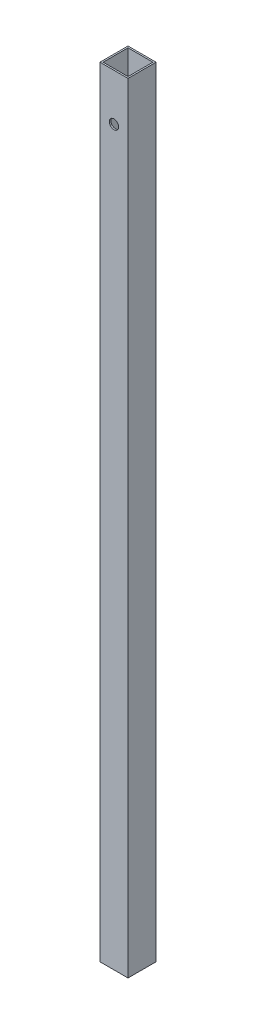
ISO-10303-21;
HEADER;
FILE_DESCRIPTION(('STEP AP214'),'2;1');
FILE_NAME('part.step','',(''),(''),'','','');
FILE_SCHEMA(('AUTOMOTIVE_DESIGN { 1 0 10303 214 1 1 1 1 }'));
ENDSEC;
DATA;
#1=APPLICATION_CONTEXT('core data for automotive mechanical design processes');
#2=APPLICATION_PROTOCOL_DEFINITION('international standard','automotive_design',2000,#1);
#3=PRODUCT_CONTEXT('',#1,'mechanical');
#4=PRODUCT('Part','Part','',(#3));
#5=PRODUCT_RELATED_PRODUCT_CATEGORY('part','',(#4));
#6=PRODUCT_DEFINITION_FORMATION('','',#4);
#7=PRODUCT_DEFINITION_CONTEXT('part definition',#1,'design');
#8=PRODUCT_DEFINITION('design','',#6,#7);
#9=PRODUCT_DEFINITION_SHAPE('','',#8);
#10=(LENGTH_UNIT() NAMED_UNIT(*) SI_UNIT(.MILLI.,.METRE.));
#11=(NAMED_UNIT(*) PLANE_ANGLE_UNIT() SI_UNIT($,.RADIAN.));
#12=(NAMED_UNIT(*) SI_UNIT($,.STERADIAN.) SOLID_ANGLE_UNIT());
#13=UNCERTAINTY_MEASURE_WITH_UNIT(LENGTH_MEASURE(1.E-05),#10,'distance_accuracy_value','');
#14=(GEOMETRIC_REPRESENTATION_CONTEXT(3) GLOBAL_UNCERTAINTY_ASSIGNED_CONTEXT((#13)) GLOBAL_UNIT_ASSIGNED_CONTEXT((#10,
#11,#12)) REPRESENTATION_CONTEXT('',''));
#15=CARTESIAN_POINT('',(0.,0.,0.));
#16=DIRECTION('',(0.,0.,1.));
#17=DIRECTION('',(1.,0.,0.));
#18=AXIS2_PLACEMENT_3D('',#15,#16,#17);
#19=CARTESIAN_POINT('',(0.,500.,0.));
#20=DIRECTION('',(0.,1.,0.));
#21=DIRECTION('',(0.,0.,1.));
#22=AXIS2_PLACEMENT_3D('',#19,#20,#21);
#23=PLANE('',#22);
#24=DIRECTION('',(0.,0.,-1.));
#25=VECTOR('',#24,1.);
#26=CARTESIAN_POINT('',(9.00000000000001,500.,-9.));
#27=LINE('',#26,#25);
#28=CARTESIAN_POINT('',(9.00000000000001,500.,9.00000000000001));
#29=VERTEX_POINT('',#28);
#30=CARTESIAN_POINT('',(9.00000000000001,500.,-9.));
#31=VERTEX_POINT('',#30);
#32=EDGE_CURVE('E142',#29,#31,#27,.T.);
#33=ORIENTED_EDGE('',*,*,#32,.T.);
#34=DIRECTION('',(-1.,0.,0.));
#35=VECTOR('',#34,1.);
#36=CARTESIAN_POINT('',(-9.,500.,-9.));
#37=LINE('',#36,#35);
#38=CARTESIAN_POINT('',(-9.,500.,-9.));
#39=VERTEX_POINT('',#38);
#40=EDGE_CURVE('E145',#31,#39,#37,.T.);
#41=ORIENTED_EDGE('',*,*,#40,.T.);
#42=DIRECTION('',(0.,0.,1.));
#43=VECTOR('',#42,1.);
#44=CARTESIAN_POINT('',(-9.,500.,-9.));
#45=LINE('',#44,#43);
#46=CARTESIAN_POINT('',(-8.99999999999999,500.,9.00000000000001));
#47=VERTEX_POINT('',#46);
#48=EDGE_CURVE('E148',#39,#47,#45,.T.);
#49=ORIENTED_EDGE('',*,*,#48,.T.);
#50=DIRECTION('',(1.,0.,0.));
#51=VECTOR('',#50,1.);
#52=CARTESIAN_POINT('',(-8.99999999999999,500.,9.00000000000001));
#53=LINE('',#52,#51);
#54=EDGE_CURVE('E150',#47,#29,#53,.T.);
#55=ORIENTED_EDGE('',*,*,#54,.T.);
#56=EDGE_LOOP('',(#33,#41,#49,#55));
#57=FACE_BOUND('',#56,.T.);
#58=DIRECTION('',(0.,0.,1.));
#59=VECTOR('',#58,1.);
#60=CARTESIAN_POINT('',(-8.,500.,-8.));
#61=LINE('',#60,#59);
#62=CARTESIAN_POINT('',(-8.,500.,-8.));
#63=VERTEX_POINT('',#62);
#64=CARTESIAN_POINT('',(-7.99999999999999,500.,8.00000000000001));
#65=VERTEX_POINT('',#64);
#66=EDGE_CURVE('E112',#63,#65,#61,.T.);
#67=ORIENTED_EDGE('',*,*,#66,.F.);
#68=DIRECTION('',(-1.,0.,0.));
#69=VECTOR('',#68,1.);
#70=CARTESIAN_POINT('',(-8.,500.,-8.));
#71=LINE('',#70,#69);
#72=CARTESIAN_POINT('',(8.,500.,-8.));
#73=VERTEX_POINT('',#72);
#74=EDGE_CURVE('E104',#73,#63,#71,.T.);
#75=ORIENTED_EDGE('',*,*,#74,.F.);
#76=DIRECTION('',(0.,0.,-1.));
#77=VECTOR('',#76,1.);
#78=CARTESIAN_POINT('',(8.,500.,-8.));
#79=LINE('',#78,#77);
#80=CARTESIAN_POINT('',(8.00000000000001,500.,8.00000000000001));
#81=VERTEX_POINT('',#80);
#82=EDGE_CURVE('E126',#81,#73,#79,.T.);
#83=ORIENTED_EDGE('',*,*,#82,.F.);
#84=DIRECTION('',(1.,0.,0.));
#85=VECTOR('',#84,1.);
#86=CARTESIAN_POINT('',(-7.99999999999999,500.,8.00000000000001));
#87=LINE('',#86,#85);
#88=EDGE_CURVE('E124',#65,#81,#87,.T.);
#89=ORIENTED_EDGE('',*,*,#88,.F.);
#90=EDGE_LOOP('',(#67,#75,#83,#89));
#91=FACE_BOUND('',#90,.T.);
#92=ADVANCED_FACE('F38',(#57,#91),#23,.T.);
#93=CARTESIAN_POINT('',(0.,0.,0.));
#94=DIRECTION('',(0.,1.,0.));
#95=DIRECTION('',(0.,0.,1.));
#96=AXIS2_PLACEMENT_3D('',#93,#94,#95);
#97=PLANE('',#96);
#98=DIRECTION('',(0.,0.,-1.));
#99=VECTOR('',#98,1.);
#100=CARTESIAN_POINT('',(9.00000000000001,0.,-9.));
#101=LINE('',#100,#99);
#102=CARTESIAN_POINT('',(9.00000000000001,0.,9.00000000000001));
#103=VERTEX_POINT('',#102);
#104=CARTESIAN_POINT('',(9.00000000000001,0.,-9.));
#105=VERTEX_POINT('',#104);
#106=EDGE_CURVE('E120',#103,#105,#101,.T.);
#107=ORIENTED_EDGE('',*,*,#106,.F.);
#108=DIRECTION('',(1.,0.,0.));
#109=VECTOR('',#108,1.);
#110=CARTESIAN_POINT('',(-8.99999999999999,0.,9.00000000000001));
#111=LINE('',#110,#109);
#112=CARTESIAN_POINT('',(-8.99999999999999,0.,9.00000000000001));
#113=VERTEX_POINT('',#112);
#114=EDGE_CURVE('E146',#113,#103,#111,.T.);
#115=ORIENTED_EDGE('',*,*,#114,.F.);
#116=DIRECTION('',(0.,0.,1.));
#117=VECTOR('',#116,1.);
#118=CARTESIAN_POINT('',(-9.,0.,-9.));
#119=LINE('',#118,#117);
#120=CARTESIAN_POINT('',(-9.,0.,-9.));
#121=VERTEX_POINT('',#120);
#122=EDGE_CURVE('E157',#121,#113,#119,.T.);
#123=ORIENTED_EDGE('',*,*,#122,.F.);
#124=DIRECTION('',(-1.,0.,0.));
#125=VECTOR('',#124,1.);
#126=CARTESIAN_POINT('',(-9.,0.,-9.));
#127=LINE('',#126,#125);
#128=EDGE_CURVE('E155',#105,#121,#127,.T.);
#129=ORIENTED_EDGE('',*,*,#128,.F.);
#130=EDGE_LOOP('',(#107,#115,#123,#129));
#131=FACE_BOUND('',#130,.T.);
#132=DIRECTION('',(-1.,0.,0.));
#133=VECTOR('',#132,1.);
#134=CARTESIAN_POINT('',(-8.,0.,-8.));
#135=LINE('',#134,#133);
#136=CARTESIAN_POINT('',(8.,0.,-8.));
#137=VERTEX_POINT('',#136);
#138=CARTESIAN_POINT('',(-8.,0.,-8.));
#139=VERTEX_POINT('',#138);
#140=EDGE_CURVE('E62',#137,#139,#135,.T.);
#141=ORIENTED_EDGE('',*,*,#140,.T.);
#142=DIRECTION('',(0.,0.,1.));
#143=VECTOR('',#142,1.);
#144=CARTESIAN_POINT('',(-8.,0.,-8.));
#145=LINE('',#144,#143);
#146=CARTESIAN_POINT('',(-7.99999999999999,0.,8.00000000000001));
#147=VERTEX_POINT('',#146);
#148=EDGE_CURVE('E119',#139,#147,#145,.T.);
#149=ORIENTED_EDGE('',*,*,#148,.T.);
#150=DIRECTION('',(1.,0.,0.));
#151=VECTOR('',#150,1.);
#152=CARTESIAN_POINT('',(-7.99999999999999,0.,8.00000000000001));
#153=LINE('',#152,#151);
#154=CARTESIAN_POINT('',(8.00000000000001,0.,8.00000000000001));
#155=VERTEX_POINT('',#154);
#156=EDGE_CURVE('E134',#147,#155,#153,.T.);
#157=ORIENTED_EDGE('',*,*,#156,.T.);
#158=DIRECTION('',(0.,0.,-1.));
#159=VECTOR('',#158,1.);
#160=CARTESIAN_POINT('',(8.,0.,-8.));
#161=LINE('',#160,#159);
#162=EDGE_CURVE('E113',#155,#137,#161,.T.);
#163=ORIENTED_EDGE('',*,*,#162,.T.);
#164=EDGE_LOOP('',(#141,#149,#157,#163));
#165=FACE_BOUND('',#164,.T.);
#166=ADVANCED_FACE('F176',(#131,#165),#97,.F.);
#167=CARTESIAN_POINT('',(9.00000000000001,500.,-9.));
#168=DIRECTION('',(-1.,0.,0.));
#169=DIRECTION('',(0.,0.,1.));
#170=AXIS2_PLACEMENT_3D('',#167,#168,#169);
#171=PLANE('',#170);
#172=ORIENTED_EDGE('',*,*,#106,.T.);
#173=DIRECTION('',(0.,-1.,0.));
#174=VECTOR('',#173,1.);
#175=CARTESIAN_POINT('',(9.00000000000001,500.,-9.));
#176=LINE('',#175,#174);
#177=EDGE_CURVE('E11',#31,#105,#176,.T.);
#178=ORIENTED_EDGE('',*,*,#177,.F.);
#179=ORIENTED_EDGE('',*,*,#32,.F.);
#180=DIRECTION('',(0.,-1.,0.));
#181=VECTOR('',#180,1.);
#182=CARTESIAN_POINT('',(9.00000000000001,500.,9.00000000000001));
#183=LINE('',#182,#181);
#184=EDGE_CURVE('E152',#29,#103,#183,.T.);
#185=ORIENTED_EDGE('',*,*,#184,.T.);
#186=EDGE_LOOP('',(#172,#178,#179,#185));
#187=FACE_BOUND('',#186,.T.);
#188=ADVANCED_FACE('F40',(#187),#171,.F.);
#189=CARTESIAN_POINT('',(-9.,500.,-9.));
#190=DIRECTION('',(0.,0.,1.));
#191=DIRECTION('',(1.,0.,0.));
#192=AXIS2_PLACEMENT_3D('',#189,#190,#191);
#193=PLANE('',#192);
#194=CARTESIAN_POINT('',(0.,470.,-9.00000000000001));
#195=DIRECTION('',(0.,0.,1.));
#196=DIRECTION('',(1.,0.,0.));
#197=AXIS2_PLACEMENT_3D('',#194,#195,#196);
#198=CIRCLE('',#197,3.);
#199=CARTESIAN_POINT('',(3.,470.,-9.00000000000001));
#200=VERTEX_POINT('',#199);
#201=EDGE_CURVE('E132',#200,#200,#198,.T.);
#202=ORIENTED_EDGE('',*,*,#201,.T.);
#203=EDGE_LOOP('',(#202));
#204=FACE_BOUND('',#203,.T.);
#205=ORIENTED_EDGE('',*,*,#128,.T.);
#206=DIRECTION('',(0.,-1.,0.));
#207=VECTOR('',#206,1.);
#208=CARTESIAN_POINT('',(-9.,500.,-9.));
#209=LINE('',#208,#207);
#210=EDGE_CURVE('E47',#39,#121,#209,.T.);
#211=ORIENTED_EDGE('',*,*,#210,.F.);
#212=ORIENTED_EDGE('',*,*,#40,.F.);
#213=ORIENTED_EDGE('',*,*,#177,.T.);
#214=EDGE_LOOP('',(#205,#211,#212,#213));
#215=FACE_BOUND('',#214,.T.);
#216=ADVANCED_FACE('F186',(#204,#215),#193,.F.);
#217=CARTESIAN_POINT('',(-9.,500.,-9.));
#218=DIRECTION('',(1.,0.,0.));
#219=DIRECTION('',(0.,0.,-1.));
#220=AXIS2_PLACEMENT_3D('',#217,#218,#219);
#221=PLANE('',#220);
#222=ORIENTED_EDGE('',*,*,#122,.T.);
#223=DIRECTION('',(0.,-1.,0.));
#224=VECTOR('',#223,1.);
#225=CARTESIAN_POINT('',(-8.99999999999999,500.,9.00000000000001));
#226=LINE('',#225,#224);
#227=EDGE_CURVE('E162',#47,#113,#226,.T.);
#228=ORIENTED_EDGE('',*,*,#227,.F.);
#229=ORIENTED_EDGE('',*,*,#48,.F.);
#230=ORIENTED_EDGE('',*,*,#210,.T.);
#231=EDGE_LOOP('',(#222,#228,#229,#230));
#232=FACE_BOUND('',#231,.T.);
#233=ADVANCED_FACE('F170',(#232),#221,.F.);
#234=CARTESIAN_POINT('',(-8.99999999999999,500.,9.00000000000001));
#235=DIRECTION('',(0.,0.,-1.));
#236=DIRECTION('',(-1.,0.,0.));
#237=AXIS2_PLACEMENT_3D('',#234,#235,#236);
#238=PLANE('',#237);
#239=CARTESIAN_POINT('',(0.,470.,9.00000000000001));
#240=DIRECTION('',(0.,0.,1.));
#241=DIRECTION('',(1.,0.,0.));
#242=AXIS2_PLACEMENT_3D('',#239,#240,#241);
#243=CIRCLE('',#242,3.);
#244=CARTESIAN_POINT('',(3.,470.,9.00000000000001));
#245=VERTEX_POINT('',#244);
#246=EDGE_CURVE('E213',#245,#245,#243,.T.);
#247=ORIENTED_EDGE('',*,*,#246,.F.);
#248=EDGE_LOOP('',(#247));
#249=FACE_BOUND('',#248,.T.);
#250=ORIENTED_EDGE('',*,*,#114,.T.);
#251=ORIENTED_EDGE('',*,*,#184,.F.);
#252=ORIENTED_EDGE('',*,*,#54,.F.);
#253=ORIENTED_EDGE('',*,*,#227,.T.);
#254=EDGE_LOOP('',(#250,#251,#252,#253));
#255=FACE_BOUND('',#254,.T.);
#256=ADVANCED_FACE('F180',(#249,#255),#238,.F.);
#257=CARTESIAN_POINT('',(-8.,500.,-8.));
#258=DIRECTION('',(0.,0.,1.));
#259=DIRECTION('',(1.,0.,0.));
#260=AXIS2_PLACEMENT_3D('',#257,#258,#259);
#261=PLANE('',#260);
#262=CARTESIAN_POINT('',(0.,470.,-8.00000000000001));
#263=DIRECTION('',(0.,0.,1.));
#264=DIRECTION('',(1.,0.,0.));
#265=AXIS2_PLACEMENT_3D('',#262,#263,#264);
#266=CIRCLE('',#265,3.);
#267=CARTESIAN_POINT('',(3.,470.,-8.00000000000001));
#268=VERTEX_POINT('',#267);
#269=EDGE_CURVE('E217',#268,#268,#266,.T.);
#270=ORIENTED_EDGE('',*,*,#269,.F.);
#271=EDGE_LOOP('',(#270));
#272=FACE_BOUND('',#271,.T.);
#273=ORIENTED_EDGE('',*,*,#140,.F.);
#274=DIRECTION('',(0.,-1.,0.));
#275=VECTOR('',#274,1.);
#276=CARTESIAN_POINT('',(8.,500.,-8.));
#277=LINE('',#276,#275);
#278=EDGE_CURVE('E108',#73,#137,#277,.T.);
#279=ORIENTED_EDGE('',*,*,#278,.F.);
#280=ORIENTED_EDGE('',*,*,#74,.T.);
#281=DIRECTION('',(0.,-1.,0.));
#282=VECTOR('',#281,1.);
#283=CARTESIAN_POINT('',(-8.,500.,-8.));
#284=LINE('',#283,#282);
#285=EDGE_CURVE('E107',#63,#139,#284,.T.);
#286=ORIENTED_EDGE('',*,*,#285,.T.);
#287=EDGE_LOOP('',(#273,#279,#280,#286));
#288=FACE_BOUND('',#287,.T.);
#289=ADVANCED_FACE('F106',(#272,#288),#261,.T.);
#290=CARTESIAN_POINT('',(-8.,500.,-8.));
#291=DIRECTION('',(1.,0.,0.));
#292=DIRECTION('',(0.,0.,-1.));
#293=AXIS2_PLACEMENT_3D('',#290,#291,#292);
#294=PLANE('',#293);
#295=ORIENTED_EDGE('',*,*,#148,.F.);
#296=ORIENTED_EDGE('',*,*,#285,.F.);
#297=ORIENTED_EDGE('',*,*,#66,.T.);
#298=DIRECTION('',(0.,-1.,0.));
#299=VECTOR('',#298,1.);
#300=CARTESIAN_POINT('',(-7.99999999999999,500.,8.00000000000001));
#301=LINE('',#300,#299);
#302=EDGE_CURVE('E121',#65,#147,#301,.T.);
#303=ORIENTED_EDGE('',*,*,#302,.T.);
#304=EDGE_LOOP('',(#295,#296,#297,#303));
#305=FACE_BOUND('',#304,.T.);
#306=ADVANCED_FACE('F116',(#305),#294,.T.);
#307=CARTESIAN_POINT('',(-7.99999999999999,500.,8.00000000000001));
#308=DIRECTION('',(0.,0.,-1.));
#309=DIRECTION('',(-1.,0.,0.));
#310=AXIS2_PLACEMENT_3D('',#307,#308,#309);
#311=PLANE('',#310);
#312=CARTESIAN_POINT('',(0.,470.,8.00000000000001));
#313=DIRECTION('',(0.,0.,-1.));
#314=DIRECTION('',(-1.,0.,0.));
#315=AXIS2_PLACEMENT_3D('',#312,#313,#314);
#316=CIRCLE('',#315,3.);
#317=CARTESIAN_POINT('',(-3.,470.,8.00000000000001));
#318=VERTEX_POINT('',#317);
#319=EDGE_CURVE('E42',#318,#318,#316,.T.);
#320=ORIENTED_EDGE('',*,*,#319,.F.);
#321=EDGE_LOOP('',(#320));
#322=FACE_BOUND('',#321,.T.);
#323=ORIENTED_EDGE('',*,*,#156,.F.);
#324=ORIENTED_EDGE('',*,*,#302,.F.);
#325=ORIENTED_EDGE('',*,*,#88,.T.);
#326=DIRECTION('',(0.,-1.,0.));
#327=VECTOR('',#326,1.);
#328=CARTESIAN_POINT('',(8.00000000000001,500.,8.00000000000001));
#329=LINE('',#328,#327);
#330=EDGE_CURVE('E54',#81,#155,#329,.T.);
#331=ORIENTED_EDGE('',*,*,#330,.T.);
#332=EDGE_LOOP('',(#323,#324,#325,#331));
#333=FACE_BOUND('',#332,.T.);
#334=ADVANCED_FACE('F234',(#322,#333),#311,.T.);
#335=CARTESIAN_POINT('',(8.,500.,-8.));
#336=DIRECTION('',(-1.,0.,0.));
#337=DIRECTION('',(0.,0.,1.));
#338=AXIS2_PLACEMENT_3D('',#335,#336,#337);
#339=PLANE('',#338);
#340=ORIENTED_EDGE('',*,*,#162,.F.);
#341=ORIENTED_EDGE('',*,*,#330,.F.);
#342=ORIENTED_EDGE('',*,*,#82,.T.);
#343=ORIENTED_EDGE('',*,*,#278,.T.);
#344=EDGE_LOOP('',(#340,#341,#342,#343));
#345=FACE_BOUND('',#344,.T.);
#346=ADVANCED_FACE('F230',(#345),#339,.T.);
#347=CARTESIAN_POINT('',(0.,470.,-984.));
#348=DIRECTION('',(0.,0.,1.));
#349=DIRECTION('',(1.,0.,0.));
#350=AXIS2_PLACEMENT_3D('',#347,#348,#349);
#351=CYLINDRICAL_SURFACE('',#350,3.);
#352=ORIENTED_EDGE('',*,*,#319,.T.);
#353=EDGE_LOOP('',(#352));
#354=FACE_BOUND('',#353,.T.);
#355=ORIENTED_EDGE('',*,*,#246,.T.);
#356=EDGE_LOOP('',(#355));
#357=FACE_BOUND('',#356,.T.);
#358=ADVANCED_FACE('F224',(#354,#357),#351,.F.);
#359=ORIENTED_EDGE('',*,*,#269,.T.);
#360=EDGE_LOOP('',(#359));
#361=FACE_BOUND('',#360,.T.);
#362=ORIENTED_EDGE('',*,*,#201,.F.);
#363=EDGE_LOOP('',(#362));
#364=FACE_BOUND('',#363,.T.);
#365=ADVANCED_FACE('F222',(#361,#364),#351,.F.);
#366=CLOSED_SHELL('',(#92,#166,#188,#216,#233,#256,#289,#306,#334,#346,#358,#365));
#367=MANIFOLD_SOLID_BREP('B2',#366);
#368=ADVANCED_BREP_SHAPE_REPRESENTATION('',(#18,#367),#14);
#369=SHAPE_DEFINITION_REPRESENTATION(#9,#368);
ENDSEC;
END-ISO-10303-21;
